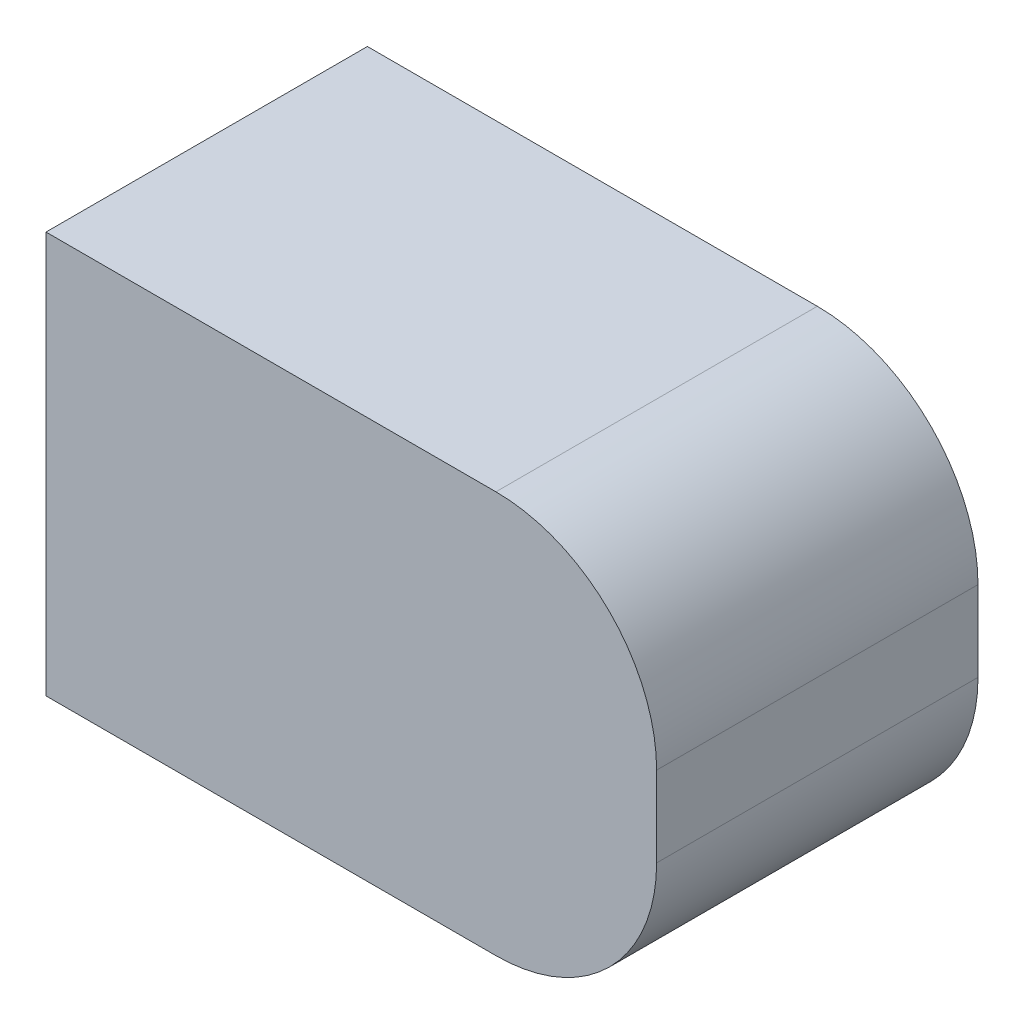
ISO-10303-21;
HEADER;
FILE_DESCRIPTION(('STEP AP214'),'2;1');
FILE_NAME('part.step','',(''),(''),'','','');
FILE_SCHEMA(('AUTOMOTIVE_DESIGN { 1 0 10303 214 1 1 1 1 }'));
ENDSEC;
DATA;
#1=APPLICATION_CONTEXT('core data for automotive mechanical design processes');
#2=APPLICATION_PROTOCOL_DEFINITION('international standard','automotive_design',2000,#1);
#3=PRODUCT_CONTEXT('',#1,'mechanical');
#4=PRODUCT('Part','Part','',(#3));
#5=PRODUCT_RELATED_PRODUCT_CATEGORY('part','',(#4));
#6=PRODUCT_DEFINITION_FORMATION('','',#4);
#7=PRODUCT_DEFINITION_CONTEXT('part definition',#1,'design');
#8=PRODUCT_DEFINITION('design','',#6,#7);
#9=PRODUCT_DEFINITION_SHAPE('','',#8);
#10=(LENGTH_UNIT() NAMED_UNIT(*) SI_UNIT(.MILLI.,.METRE.));
#11=(NAMED_UNIT(*) PLANE_ANGLE_UNIT() SI_UNIT($,.RADIAN.));
#12=(NAMED_UNIT(*) SI_UNIT($,.STERADIAN.) SOLID_ANGLE_UNIT());
#13=UNCERTAINTY_MEASURE_WITH_UNIT(LENGTH_MEASURE(1.E-05),#10,'distance_accuracy_value','');
#14=(GEOMETRIC_REPRESENTATION_CONTEXT(3) GLOBAL_UNCERTAINTY_ASSIGNED_CONTEXT((#13)) GLOBAL_UNIT_ASSIGNED_CONTEXT((#10,
#11,#12)) REPRESENTATION_CONTEXT('',''));
#15=CARTESIAN_POINT('',(0.,0.,0.));
#16=DIRECTION('',(0.,0.,1.));
#17=DIRECTION('',(1.,0.,0.));
#18=AXIS2_PLACEMENT_3D('',#15,#16,#17);
#19=CARTESIAN_POINT('',(-1.223,-0.975,0.));
#20=DIRECTION('',(0.,0.,1.));
#21=DIRECTION('',(0.707106781186548,0.707106781186547,0.));
#22=AXIS2_PLACEMENT_3D('',#19,#20,#21);
#23=CYLINDRICAL_SURFACE('',#22,0.1);
#24=CARTESIAN_POINT('',(-1.223,-0.975,0.2));
#25=DIRECTION('',(0.,0.,-1.));
#26=DIRECTION('',(0.707106781186548,0.707106781186547,0.));
#27=AXIS2_PLACEMENT_3D('',#24,#25,#26);
#28=CIRCLE('',#27,0.1);
#29=CARTESIAN_POINT('',(-1.223,-0.875,0.2));
#30=VERTEX_POINT('',#29);
#31=CARTESIAN_POINT('',(-1.123,-0.975,0.2));
#32=VERTEX_POINT('',#31);
#33=EDGE_CURVE('E11',#30,#32,#28,.T.);
#34=ORIENTED_EDGE('',*,*,#33,.T.);
#35=DIRECTION('',(0.,0.,-1.));
#36=VECTOR('',#35,1.);
#37=CARTESIAN_POINT('',(-1.123,-0.975,0.));
#38=LINE('',#37,#36);
#39=CARTESIAN_POINT('',(-1.123,-0.975,0.));
#40=VERTEX_POINT('',#39);
#41=EDGE_CURVE('E24',#32,#40,#38,.T.);
#42=ORIENTED_EDGE('',*,*,#41,.T.);
#43=CARTESIAN_POINT('',(-1.223,-0.975,0.));
#44=DIRECTION('',(0.,0.,1.));
#45=DIRECTION('',(0.707106781186548,0.707106781186547,0.));
#46=AXIS2_PLACEMENT_3D('',#43,#44,#45);
#47=CIRCLE('',#46,0.1);
#48=CARTESIAN_POINT('',(-1.223,-0.875,0.));
#49=VERTEX_POINT('',#48);
#50=EDGE_CURVE('E115',#40,#49,#47,.T.);
#51=ORIENTED_EDGE('',*,*,#50,.T.);
#52=DIRECTION('',(0.,0.,1.));
#53=VECTOR('',#52,1.);
#54=CARTESIAN_POINT('',(-1.223,-0.875,0.));
#55=LINE('',#54,#53);
#56=EDGE_CURVE('E113',#49,#30,#55,.T.);
#57=ORIENTED_EDGE('',*,*,#56,.T.);
#58=EDGE_LOOP('',(#34,#42,#51,#57));
#59=FACE_BOUND('',#58,.T.);
#60=ADVANCED_FACE('F17',(#59),#23,.T.);
#61=CARTESIAN_POINT('',(-1.313,-1.,0.));
#62=DIRECTION('',(0.,0.,1.));
#63=DIRECTION('',(1.,0.,0.));
#64=AXIS2_PLACEMENT_3D('',#61,#62,#63);
#65=PLANE('',#64);
#66=ORIENTED_EDGE('',*,*,#50,.F.);
#67=DIRECTION('',(0.,1.,0.));
#68=VECTOR('',#67,1.);
#69=CARTESIAN_POINT('',(-1.123,-1.125,0.));
#70=LINE('',#69,#68);
#71=CARTESIAN_POINT('',(-1.123,-1.025,0.));
#72=VERTEX_POINT('',#71);
#73=EDGE_CURVE('E110',#72,#40,#70,.T.);
#74=ORIENTED_EDGE('',*,*,#73,.F.);
#75=CARTESIAN_POINT('',(-1.223,-1.025,0.));
#76=DIRECTION('',(0.,0.,1.));
#77=DIRECTION('',(0.707106781186565,-0.70710678118653,0.));
#78=AXIS2_PLACEMENT_3D('',#75,#76,#77);
#79=CIRCLE('',#78,0.1);
#80=CARTESIAN_POINT('',(-1.223,-1.125,0.));
#81=VERTEX_POINT('',#80);
#82=EDGE_CURVE('E107',#81,#72,#79,.T.);
#83=ORIENTED_EDGE('',*,*,#82,.F.);
#84=DIRECTION('',(1.,0.,0.));
#85=VECTOR('',#84,1.);
#86=CARTESIAN_POINT('',(-1.503,-1.125,0.));
#87=LINE('',#86,#85);
#88=CARTESIAN_POINT('',(-1.503,-1.125,0.));
#89=VERTEX_POINT('',#88);
#90=EDGE_CURVE('E105',#89,#81,#87,.T.);
#91=ORIENTED_EDGE('',*,*,#90,.F.);
#92=DIRECTION('',(0.,-1.,0.));
#93=VECTOR('',#92,1.);
#94=CARTESIAN_POINT('',(-1.503,-0.875,0.));
#95=LINE('',#94,#93);
#96=CARTESIAN_POINT('',(-1.503,-0.875,0.));
#97=VERTEX_POINT('',#96);
#98=EDGE_CURVE('E84',#97,#89,#95,.T.);
#99=ORIENTED_EDGE('',*,*,#98,.F.);
#100=DIRECTION('',(-1.,0.,0.));
#101=VECTOR('',#100,1.);
#102=CARTESIAN_POINT('',(-1.123,-0.875,0.));
#103=LINE('',#102,#101);
#104=EDGE_CURVE('E101',#49,#97,#103,.T.);
#105=ORIENTED_EDGE('',*,*,#104,.F.);
#106=EDGE_LOOP('',(#66,#74,#83,#91,#99,#105));
#107=FACE_BOUND('',#106,.T.);
#108=ADVANCED_FACE('F121',(#107),#65,.F.);
#109=CARTESIAN_POINT('',(-1.123,-1.125,0.));
#110=DIRECTION('',(1.,0.,0.));
#111=DIRECTION('',(0.,1.,0.));
#112=AXIS2_PLACEMENT_3D('',#109,#110,#111);
#113=PLANE('',#112);
#114=ORIENTED_EDGE('',*,*,#41,.F.);
#115=DIRECTION('',(0.,1.,0.));
#116=VECTOR('',#115,1.);
#117=CARTESIAN_POINT('',(-1.123,-1.125,0.2));
#118=LINE('',#117,#116);
#119=CARTESIAN_POINT('',(-1.123,-1.025,0.2));
#120=VERTEX_POINT('',#119);
#121=EDGE_CURVE('E99',#120,#32,#118,.T.);
#122=ORIENTED_EDGE('',*,*,#121,.F.);
#123=DIRECTION('',(0.,0.,1.));
#124=VECTOR('',#123,1.);
#125=CARTESIAN_POINT('',(-1.123,-1.025,0.));
#126=LINE('',#125,#124);
#127=EDGE_CURVE('E96',#72,#120,#126,.T.);
#128=ORIENTED_EDGE('',*,*,#127,.F.);
#129=ORIENTED_EDGE('',*,*,#73,.T.);
#130=EDGE_LOOP('',(#114,#122,#128,#129));
#131=FACE_BOUND('',#130,.T.);
#132=ADVANCED_FACE('F123',(#131),#113,.T.);
#133=CARTESIAN_POINT('',(-1.223,-1.025,0.));
#134=DIRECTION('',(0.,0.,1.));
#135=DIRECTION('',(0.707106781186565,-0.70710678118653,0.));
#136=AXIS2_PLACEMENT_3D('',#133,#134,#135);
#137=CYLINDRICAL_SURFACE('',#136,0.1);
#138=CARTESIAN_POINT('',(-1.223,-1.025,0.2));
#139=DIRECTION('',(0.,0.,-1.));
#140=DIRECTION('',(0.707106781186565,-0.70710678118653,0.));
#141=AXIS2_PLACEMENT_3D('',#138,#139,#140);
#142=CIRCLE('',#141,0.1);
#143=CARTESIAN_POINT('',(-1.223,-1.125,0.2));
#144=VERTEX_POINT('',#143);
#145=EDGE_CURVE('E94',#120,#144,#142,.T.);
#146=ORIENTED_EDGE('',*,*,#145,.T.);
#147=DIRECTION('',(0.,0.,-1.));
#148=VECTOR('',#147,1.);
#149=CARTESIAN_POINT('',(-1.223,-1.125,0.));
#150=LINE('',#149,#148);
#151=EDGE_CURVE('E73',#144,#81,#150,.T.);
#152=ORIENTED_EDGE('',*,*,#151,.T.);
#153=ORIENTED_EDGE('',*,*,#82,.T.);
#154=ORIENTED_EDGE('',*,*,#127,.T.);
#155=EDGE_LOOP('',(#146,#152,#153,#154));
#156=FACE_BOUND('',#155,.T.);
#157=ADVANCED_FACE('F125',(#156),#137,.T.);
#158=CARTESIAN_POINT('',(-1.123,-0.875,0.));
#159=DIRECTION('',(0.,1.,0.));
#160=DIRECTION('',(-1.,0.,0.));
#161=AXIS2_PLACEMENT_3D('',#158,#159,#160);
#162=PLANE('',#161);
#163=ORIENTED_EDGE('',*,*,#56,.F.);
#164=ORIENTED_EDGE('',*,*,#104,.T.);
#165=DIRECTION('',(0.,0.,1.));
#166=VECTOR('',#165,1.);
#167=CARTESIAN_POINT('',(-1.503,-0.875,0.));
#168=LINE('',#167,#166);
#169=CARTESIAN_POINT('',(-1.503,-0.875,0.2));
#170=VERTEX_POINT('',#169);
#171=EDGE_CURVE('E91',#97,#170,#168,.T.);
#172=ORIENTED_EDGE('',*,*,#171,.T.);
#173=DIRECTION('',(-1.,0.,0.));
#174=VECTOR('',#173,1.);
#175=CARTESIAN_POINT('',(-1.123,-0.875,0.2));
#176=LINE('',#175,#174);
#177=EDGE_CURVE('E76',#30,#170,#176,.T.);
#178=ORIENTED_EDGE('',*,*,#177,.F.);
#179=EDGE_LOOP('',(#163,#164,#172,#178));
#180=FACE_BOUND('',#179,.T.);
#181=ADVANCED_FACE('F127',(#180),#162,.T.);
#182=CARTESIAN_POINT('',(-1.503,-1.125,0.));
#183=DIRECTION('',(0.,-1.,0.));
#184=DIRECTION('',(1.,0.,0.));
#185=AXIS2_PLACEMENT_3D('',#182,#183,#184);
#186=PLANE('',#185);
#187=ORIENTED_EDGE('',*,*,#151,.F.);
#188=DIRECTION('',(1.,0.,0.));
#189=VECTOR('',#188,1.);
#190=CARTESIAN_POINT('',(-1.503,-1.125,0.2));
#191=LINE('',#190,#189);
#192=CARTESIAN_POINT('',(-1.503,-1.125,0.2));
#193=VERTEX_POINT('',#192);
#194=EDGE_CURVE('E67',#193,#144,#191,.T.);
#195=ORIENTED_EDGE('',*,*,#194,.F.);
#196=DIRECTION('',(0.,0.,1.));
#197=VECTOR('',#196,1.);
#198=CARTESIAN_POINT('',(-1.503,-1.125,0.));
#199=LINE('',#198,#197);
#200=EDGE_CURVE('E71',#89,#193,#199,.T.);
#201=ORIENTED_EDGE('',*,*,#200,.F.);
#202=ORIENTED_EDGE('',*,*,#90,.T.);
#203=EDGE_LOOP('',(#187,#195,#201,#202));
#204=FACE_BOUND('',#203,.T.);
#205=ADVANCED_FACE('F69',(#204),#186,.T.);
#206=CARTESIAN_POINT('',(-1.503,-0.875,0.));
#207=DIRECTION('',(-1.,0.,0.));
#208=DIRECTION('',(0.,-1.,0.));
#209=AXIS2_PLACEMENT_3D('',#206,#207,#208);
#210=PLANE('',#209);
#211=ORIENTED_EDGE('',*,*,#98,.T.);
#212=ORIENTED_EDGE('',*,*,#200,.T.);
#213=DIRECTION('',(0.,-1.,0.));
#214=VECTOR('',#213,1.);
#215=CARTESIAN_POINT('',(-1.503,-0.875,0.2));
#216=LINE('',#215,#214);
#217=EDGE_CURVE('E83',#170,#193,#216,.T.);
#218=ORIENTED_EDGE('',*,*,#217,.F.);
#219=ORIENTED_EDGE('',*,*,#171,.F.);
#220=EDGE_LOOP('',(#211,#212,#218,#219));
#221=FACE_BOUND('',#220,.T.);
#222=ADVANCED_FACE('F81',(#221),#210,.T.);
#223=CARTESIAN_POINT('',(-1.313,-1.,0.2));
#224=DIRECTION('',(0.,0.,1.));
#225=DIRECTION('',(1.,0.,0.));
#226=AXIS2_PLACEMENT_3D('',#223,#224,#225);
#227=PLANE('',#226);
#228=ORIENTED_EDGE('',*,*,#33,.F.);
#229=ORIENTED_EDGE('',*,*,#177,.T.);
#230=ORIENTED_EDGE('',*,*,#217,.T.);
#231=ORIENTED_EDGE('',*,*,#194,.T.);
#232=ORIENTED_EDGE('',*,*,#145,.F.);
#233=ORIENTED_EDGE('',*,*,#121,.T.);
#234=EDGE_LOOP('',(#228,#229,#230,#231,#232,#233));
#235=FACE_BOUND('',#234,.T.);
#236=ADVANCED_FACE('F86',(#235),#227,.T.);
#237=CLOSED_SHELL('',(#60,#108,#132,#157,#181,#205,#222,#236));
#238=MANIFOLD_SOLID_BREP('B1',#237);
#239=ADVANCED_BREP_SHAPE_REPRESENTATION('',(#18,#238),#14);
#240=SHAPE_DEFINITION_REPRESENTATION(#9,#239);
ENDSEC;
END-ISO-10303-21;
